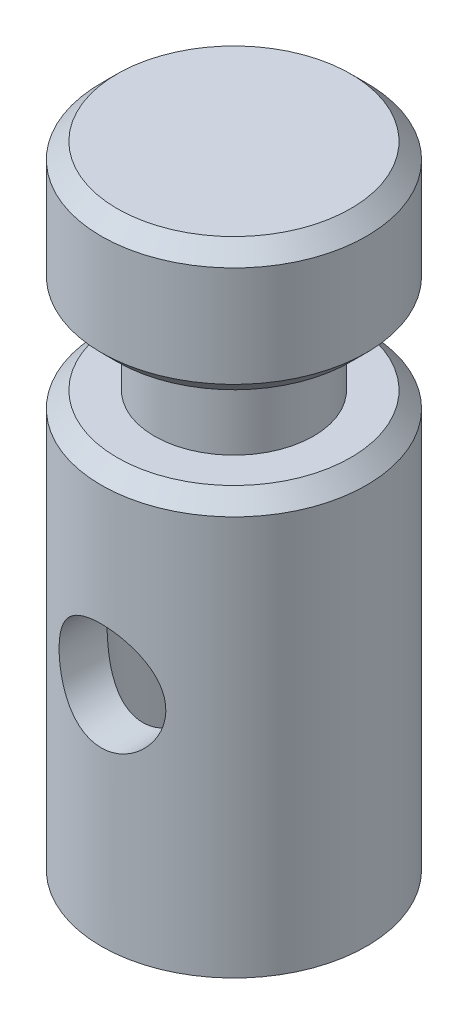
ISO-10303-21;
HEADER;
FILE_DESCRIPTION(('STEP AP214'),'2;1');
FILE_NAME('part.step','',(''),(''),'','','');
FILE_SCHEMA(('AUTOMOTIVE_DESIGN { 1 0 10303 214 1 1 1 1 }'));
ENDSEC;
DATA;
#1=APPLICATION_CONTEXT('core data for automotive mechanical design processes');
#2=APPLICATION_PROTOCOL_DEFINITION('international standard','automotive_design',2000,#1);
#3=PRODUCT_CONTEXT('',#1,'mechanical');
#4=PRODUCT('Part','Part','',(#3));
#5=PRODUCT_RELATED_PRODUCT_CATEGORY('part','',(#4));
#6=PRODUCT_DEFINITION_FORMATION('','',#4);
#7=PRODUCT_DEFINITION_CONTEXT('part definition',#1,'design');
#8=PRODUCT_DEFINITION('design','',#6,#7);
#9=PRODUCT_DEFINITION_SHAPE('','',#8);
#10=(LENGTH_UNIT() NAMED_UNIT(*) SI_UNIT(.MILLI.,.METRE.));
#11=(NAMED_UNIT(*) PLANE_ANGLE_UNIT() SI_UNIT($,.RADIAN.));
#12=(NAMED_UNIT(*) SI_UNIT($,.STERADIAN.) SOLID_ANGLE_UNIT());
#13=UNCERTAINTY_MEASURE_WITH_UNIT(LENGTH_MEASURE(1.E-05),#10,'distance_accuracy_value','');
#14=(GEOMETRIC_REPRESENTATION_CONTEXT(3) GLOBAL_UNCERTAINTY_ASSIGNED_CONTEXT((#13)) GLOBAL_UNIT_ASSIGNED_CONTEXT((#10,
#11,#12)) REPRESENTATION_CONTEXT('',''));
#15=CARTESIAN_POINT('',(0.,0.,0.));
#16=DIRECTION('',(0.,0.,1.));
#17=DIRECTION('',(1.,0.,0.));
#18=AXIS2_PLACEMENT_3D('',#15,#16,#17);
#19=CARTESIAN_POINT('',(0.,39.751,0.));
#20=DIRECTION('',(0.,-1.,0.));
#21=DIRECTION('',(0.,0.,-1.));
#22=AXIS2_PLACEMENT_3D('',#19,#20,#21);
#23=CYLINDRICAL_SURFACE('',#22,12.7);
#24=CARTESIAN_POINT('',(-3.77181718596579,18.1212140500163,12.1269697416814));
#25=CARTESIAN_POINT('',(-3.96276910871734,18.331479790591,12.0675770412481));
#26=CARTESIAN_POINT('',(-4.13655793992194,18.5579973712225,12.0085612167018));
#27=CARTESIAN_POINT('',(-4.4452734718245,19.0385215717042,11.8977595104715));
#28=CARTESIAN_POINT('',(-4.58010723982905,19.2925919705941,11.8459910674768));
#29=CARTESIAN_POINT('',(-4.74985289218351,19.6894762071165,11.7784794366222));
#30=CARTESIAN_POINT('',(-4.80107405321141,19.8246337792431,11.757640104756));
#31=CARTESIAN_POINT('',(-4.8921330150949,20.0992646778513,11.7200458273349));
#32=CARTESIAN_POINT('',(-4.93197525366238,20.2387362982957,11.7032892898901));
#33=CARTESIAN_POINT('',(-4.99984124108788,20.5208722846478,11.6744569897461));
#34=CARTESIAN_POINT('',(-5.02787488342697,20.6635338719696,11.6623773093704));
#35=CARTESIAN_POINT('',(-5.0718590222827,20.951044009711,11.6433167381532));
#36=CARTESIAN_POINT('',(-5.08781033583626,21.0958924115771,11.6363355025434));
#37=CARTESIAN_POINT('',(-5.10689601765167,21.3785084209263,11.6279711293696));
#38=CARTESIAN_POINT('',(-5.11069213689455,21.5162232139079,11.6262990001784));
#39=CARTESIAN_POINT('',(-5.10729533507349,21.7915399764374,11.627791651355));
#40=CARTESIAN_POINT('',(-5.1000986646958,21.9291418914686,11.6309580820117));
#41=CARTESIAN_POINT('',(-5.0747910311776,22.2031031491138,11.6420223819877));
#42=CARTESIAN_POINT('',(-5.05668322399909,22.339462839459,11.6499188831667));
#43=CARTESIAN_POINT('',(-5.00973971606266,22.6100337993392,11.6701825144876));
#44=CARTESIAN_POINT('',(-4.9808999308457,22.7442442305822,11.682551346693));
#45=CARTESIAN_POINT('',(-4.91366278991383,23.0060830442358,11.7109868554465));
#46=CARTESIAN_POINT('',(-4.87553399558724,23.1337918128931,11.7269488033761));
#47=CARTESIAN_POINT('',(-4.78970104597987,23.3854823524871,11.7622664153013));
#48=CARTESIAN_POINT('',(-4.74199353742511,23.5094628007049,11.7816232674691));
#49=CARTESIAN_POINT('',(-4.58504370313876,23.8746848864653,11.8439896308036));
#50=CARTESIAN_POINT('',(-4.46192538809221,24.1093951852117,11.8913165930695));
#51=CARTESIAN_POINT('',(-4.1732973008596,24.5701067354085,11.9957721911512));
#52=CARTESIAN_POINT('',(-4.00560939750171,24.7946332609024,12.0533299378264));
#53=CARTESIAN_POINT('',(-3.63603298053494,25.2134546357282,12.1699089386624));
#54=CARTESIAN_POINT('',(-3.43413138170208,25.4077378635874,12.2289307453612));
#55=CARTESIAN_POINT('',(-3.10351382465083,25.6774059104543,12.3155252184897));
#56=CARTESIAN_POINT('',(-2.98540041478488,25.7655363689735,12.3447584768584));
#57=CARTESIAN_POINT('',(-2.74167369461556,25.9314526613301,12.4011628470323));
#58=CARTESIAN_POINT('',(-2.61606331657462,26.0092425017324,12.4283347557637));
#59=CARTESIAN_POINT('',(-2.35809356693055,26.153852492098,12.4798519166861));
#60=CARTESIAN_POINT('',(-2.22573274060292,26.2206702643727,12.5041965558634));
#61=CARTESIAN_POINT('',(-1.95523790796833,26.3426717816537,12.5493358187933));
#62=CARTESIAN_POINT('',(-1.81710672636611,26.3978611408559,12.5701321547394));
#63=CARTESIAN_POINT('',(-1.5411826855351,26.4942713699108,12.6068795641394));
#64=CARTESIAN_POINT('',(-1.4035626196454,26.5359297001533,12.6229801641663));
#65=CARTESIAN_POINT('',(-1.12493089204489,26.607498805121,12.6508545383357));
#66=CARTESIAN_POINT('',(-0.983920775843403,26.6374148292376,12.6626302457671));
#67=CARTESIAN_POINT('',(-0.699590631932819,26.6851815603418,12.6815167976717));
#68=CARTESIAN_POINT('',(-0.556271086242462,26.7030347524979,12.6886286029867));
#69=CARTESIAN_POINT('',(-0.268476684467399,26.7264728543972,12.6979779271349));
#70=CARTESIAN_POINT('',(-0.124001891176247,26.732058426459,12.7002157091125));
#71=CARTESIAN_POINT('',(0.155071312499817,26.7309363742293,12.6997671620276));
#72=CARTESIAN_POINT('',(0.289674284989054,26.7250376544113,12.6974048422712));
#73=CARTESIAN_POINT('',(0.557892789727701,26.702585597814,12.6884500784288));
#74=CARTESIAN_POINT('',(0.691507979745318,26.6860287286535,12.6818562319094));
#75=CARTESIAN_POINT('',(0.956693780455195,26.6424357852721,12.6646115883794));
#76=CARTESIAN_POINT('',(1.08826518236065,26.615403877013,12.6539624042205));
#77=CARTESIAN_POINT('',(1.34856438649542,26.5511165522338,12.6288748902392));
#78=CARTESIAN_POINT('',(1.47729108969142,26.513857256533,12.6144351227644));
#79=CARTESIAN_POINT('',(1.73051948112091,26.4296266562699,12.5821906761607));
#80=CARTESIAN_POINT('',(1.85503592066784,26.3826945170368,12.5643995907601));
#81=CARTESIAN_POINT('',(2.09964751407949,26.2794301733359,12.525847099022));
#82=CARTESIAN_POINT('',(2.21974108009293,26.2230946323539,12.5050846387559));
#83=CARTESIAN_POINT('',(2.5723126524262,26.0406237670823,12.4390594715543));
#84=CARTESIAN_POINT('',(2.79726327878376,25.9009632665654,12.3900347774171));
#85=CARTESIAN_POINT('',(3.23547030307071,25.5796514559119,12.2831558437914));
#86=CARTESIAN_POINT('',(3.44708702303494,25.3959028937258,12.2249392560892));
#87=CARTESIAN_POINT('',(3.83774029087882,24.9963156024814,12.1079868117843));
#88=CARTESIAN_POINT('',(4.01676234308697,24.7804626729559,12.0492507362691));
#89=CARTESIAN_POINT('',(4.26166097168353,24.430608789737,11.9639569342589));
#90=CARTESIAN_POINT('',(4.34095614966722,24.3062861209076,11.9353392656973));
#91=CARTESIAN_POINT('',(4.48878352876408,24.0509081649402,11.8805314347358));
#92=CARTESIAN_POINT('',(4.55731992723245,23.9198555299991,11.8543403272966));
#93=CARTESIAN_POINT('',(4.68308105853712,23.6518240242448,11.8052241163442));
#94=CARTESIAN_POINT('',(4.74030429308252,23.5148443713943,11.7822994455429));
#95=CARTESIAN_POINT('',(4.84287647557451,23.2359734916343,11.7405117461151));
#96=CARTESIAN_POINT('',(4.88823120997823,23.094084696513,11.7216467390099));
#97=CARTESIAN_POINT('',(4.96519560631351,22.8116400684367,11.6892477811511));
#98=CARTESIAN_POINT('',(4.99724534063512,22.6712235791153,11.6755448340819));
#99=CARTESIAN_POINT('',(5.04955146250478,22.3878832336622,11.6530186450872));
#100=CARTESIAN_POINT('',(5.06981310232975,22.244960523483,11.6441932300274));
#101=CARTESIAN_POINT('',(5.09832667895424,21.9577268927683,11.631737114166));
#102=CARTESIAN_POINT('',(5.10658123331378,21.8134162817042,11.6281052811598));
#103=CARTESIAN_POINT('',(5.11098899520402,21.5245780920415,11.6261687051452));
#104=CARTESIAN_POINT('',(5.10714279310263,21.3800505243716,11.6278637022532));
#105=CARTESIAN_POINT('',(5.08807620022158,21.1018716129782,11.6362182911536));
#106=CARTESIAN_POINT('',(5.07365402327184,20.9681541842316,11.6425294031014));
#107=CARTESIAN_POINT('',(5.0344981628639,20.7024761033003,11.659514700073));
#108=CARTESIAN_POINT('',(5.00976107346097,20.5705160462587,11.6701903262199));
#109=CARTESIAN_POINT('',(4.95021697949083,20.3093155516272,11.6955717453469));
#110=CARTESIAN_POINT('',(4.91541248814528,20.1800744439074,11.7102765324408));
#111=CARTESIAN_POINT('',(4.83604815123563,19.9250763869468,11.7432736336639));
#112=CARTESIAN_POINT('',(4.7914845587238,19.7993207968991,11.7615673254495));
#113=CARTESIAN_POINT('',(4.64212621763297,19.4245711495633,11.8216905466086));
#114=CARTESIAN_POINT('',(4.52256913755063,19.1820480215133,11.8683549981249));
#115=CARTESIAN_POINT('',(4.24800846130576,18.7198836085234,11.9693665481484));
#116=CARTESIAN_POINT('',(4.09299185232765,18.5002507669594,12.0237164642383));
#117=CARTESIAN_POINT('',(3.73836820108481,18.0729009077759,12.1388573527753));
#118=CARTESIAN_POINT('',(3.53631640989572,17.8672559526222,12.1998277876548));
#119=CARTESIAN_POINT('',(3.09973919809829,17.492188338058,12.317977291408));
#120=CARTESIAN_POINT('',(2.8652075954145,17.3227725900228,12.3751556354391));
#121=CARTESIAN_POINT('',(2.4913759923478,17.0984261947742,12.4539052394785));
#122=CARTESIAN_POINT('',(2.36185206054746,17.0281238507163,12.479175927667));
#123=CARTESIAN_POINT('',(2.09673024245632,16.8988120043533,12.526444318242));
#124=CARTESIAN_POINT('',(1.96113487139429,16.8397978781028,12.5484433599542));
#125=CARTESIAN_POINT('',(1.68484569662164,16.7336534615323,12.5885179863698));
#126=CARTESIAN_POINT('',(1.54415296090299,16.686520698128,12.6065943874548));
#127=CARTESIAN_POINT('',(1.25871856456134,16.6046332999579,12.6382845231959));
#128=CARTESIAN_POINT('',(1.11397720480493,16.5698777480225,12.6518985885117));
#129=CARTESIAN_POINT('',(0.830871507068253,16.5149450297961,12.6735362217369));
#130=CARTESIAN_POINT('',(0.69268121373776,16.4939862380752,12.6818583868194));
#131=CARTESIAN_POINT('',(0.414849489263431,16.4635207753416,12.6939839783611));
#132=CARTESIAN_POINT('',(0.275208136977741,16.4540134852434,12.6977876490969));
#133=CARTESIAN_POINT('',(-0.0043821036097783,16.4465591745105,12.7007684764357));
#134=CARTESIAN_POINT('',(-0.144330865867718,16.4486080719213,12.6999472666703));
#135=CARTESIAN_POINT('',(-0.423477571598754,16.4642332492299,12.6937053571333));
#136=CARTESIAN_POINT('',(-0.562675532861454,16.4778092547841,12.6882847668263));
#137=CARTESIAN_POINT('',(-0.832455684723967,16.5153900475756,12.6733724036667));
#138=CARTESIAN_POINT('',(-0.963125848817985,16.5388512637075,12.6640931198247));
#139=CARTESIAN_POINT('',(-1.22196462758602,16.5958380659261,12.6417437486468));
#140=CARTESIAN_POINT('',(-1.35013239268249,16.6293670088885,12.6286723969735));
#141=CARTESIAN_POINT('',(-1.60313615901242,16.7061923192327,12.599054509338));
#142=CARTESIAN_POINT('',(-1.72797121591983,16.7494914228284,12.5825069999391));
#143=CARTESIAN_POINT('',(-1.97353516609666,16.8454781644152,12.5463379899786));
#144=CARTESIAN_POINT('',(-2.09426259561154,16.8981691083149,12.5267154072923));
#145=CARTESIAN_POINT('',(-2.4564448236815,17.0732191426911,12.4626245470742));
#146=CARTESIAN_POINT('',(-2.69023535909803,17.2102272965992,12.4138660241384));
#147=CARTESIAN_POINT('',(-3.13186395625568,17.5182636421715,12.3098707348858));
#148=CARTESIAN_POINT('',(-3.33975153668651,17.6892252492559,12.2546467333887));
#149=CARTESIAN_POINT('',(-3.57392302312484,17.9147027296095,12.1868341057623));
#150=CARTESIAN_POINT('',(-3.61446618691323,17.9550740381826,12.1748661843813));
#151=CARTESIAN_POINT('',(-3.69417752797367,18.0371483455142,12.1509169900603));
#152=CARTESIAN_POINT('',(-3.73334569074235,18.0788513583104,12.1389357169808));
#153=CARTESIAN_POINT('',(-3.77181718596579,18.1212140500163,12.1269697416814));
#154=B_SPLINE_CURVE_WITH_KNOTS('',3,(#24,#25,#26,#27,#28,#29,#30,#31,#32,#33,#34,#35,#36,#37,
#38,#39,#40,#41,#42,#43,#44,#45,#46,#47,#48,#49,#50,#51,#52,#53,#54,#55,#56,#57,#58,#59,#60,#61,
#62,#63,#64,#65,#66,#67,#68,#69,#70,#71,#72,#73,#74,#75,#76,#77,#78,#79,#80,#81,#82,#83,#84,#85,
#86,#87,#88,#89,#90,#91,#92,#93,#94,#95,#96,#97,#98,#99,#100,#101,#102,#103,#104,#105,#106,#107,
#108,#109,#110,#111,#112,#113,#114,#115,#116,#117,#118,#119,#120,#121,#122,#123,#124,#125,#126,
#127,#128,#129,#130,#131,#132,#133,#134,#135,#136,#137,#138,#139,#140,#141,#142,#143,#144,#145,
#146,#147,#148,#149,#150,#151,#152,#153),.UNSPECIFIED.,.T.,.F.,(4,2,2,2,2,2,2,2,2,2,2,2,2,2,2,2,
2,2,2,2,2,2,2,2,2,2,2,2,2,2,2,2,2,2,2,2,2,2,2,2,2,2,2,2,2,2,2,2,2,2,2,2,2,2,2,2,2,2,2,2,2,2,2,2,
4),(0.,0.870325793777426,1.74271104222307,2.18033144273261,2.61778094011256,3.05486320094055,
3.49191590254705,3.90473019814493,4.31768532386917,4.73052106281165,5.1435140829283,
5.54574804016576,5.94812305598112,6.75229376142162,7.60701139169735,8.46205665447079,
8.9123165615474,9.36240149971053,9.81258384462424,10.2625483410035,10.6960376493083,
11.1293329451327,11.5625389467986,11.9957215594571,12.3994930173615,12.8033983643286,
13.2071432412369,13.6110414680266,14.0133353546335,14.4157722877418,15.2200730893395,
16.0752476990156,16.9308017023825,17.3809684519407,17.8309591377548,18.2810093794961,
18.7308397898428,19.1643030509437,19.597573030926,20.0307485433342,20.4639029224392,
20.8673485735435,21.2709275464851,21.6744058569775,22.0780393529701,22.8973928962485,
23.7170476068233,24.5971273153919,25.4773747655746,25.9254619578619,26.373365207142,
26.8211751490423,27.2689519006618,27.6884690032347,28.1079634250599,28.5273096795175,
28.9466459538778,29.3454360055552,29.7443591734711,30.1433942020661,30.5425699685533,
31.364830520097,32.1854942188302,32.3608387823871,32.5361851949064),.UNSPECIFIED.);
#155=CARTESIAN_POINT('',(-3.77181718596579,18.1212140500163,12.1269697416814));
#156=VERTEX_POINT('',#155);
#157=EDGE_CURVE('E79',#156,#156,#154,.T.);
#158=ORIENTED_EDGE('',*,*,#157,.T.);
#159=EDGE_LOOP('',(#158));
#160=FACE_BOUND('',#159,.T.);
#161=CARTESIAN_POINT('',(0.,38.227,0.));
#162=DIRECTION('',(0.,1.,0.));
#163=DIRECTION('',(0.,0.,1.));
#164=AXIS2_PLACEMENT_3D('',#161,#162,#163);
#165=CIRCLE('',#164,12.7);
#166=CARTESIAN_POINT('',(0.,38.227,12.7));
#167=VERTEX_POINT('',#166);
#168=EDGE_CURVE('E10',#167,#167,#165,.F.);
#169=ORIENTED_EDGE('',*,*,#168,.T.);
#170=EDGE_LOOP('',(#169));
#171=FACE_BOUND('',#170,.T.);
#172=CARTESIAN_POINT('',(0.,0.,0.));
#173=DIRECTION('',(0.,1.,0.));
#174=DIRECTION('',(0.,0.,1.));
#175=AXIS2_PLACEMENT_3D('',#172,#173,#174);
#176=CIRCLE('',#175,12.7);
#177=CARTESIAN_POINT('',(0.,0.,12.7));
#178=VERTEX_POINT('',#177);
#179=EDGE_CURVE('E59',#178,#178,#176,.T.);
#180=ORIENTED_EDGE('',*,*,#179,.T.);
#181=EDGE_LOOP('',(#180));
#182=FACE_BOUND('',#181,.T.);
#183=ADVANCED_FACE('F32',(#160,#171,#182),#23,.T.);
#184=CARTESIAN_POINT('',(0.,39.751,0.));
#185=DIRECTION('',(0.,1.,0.));
#186=DIRECTION('',(0.,0.,1.));
#187=AXIS2_PLACEMENT_3D('',#184,#185,#186);
#188=PLANE('',#187);
#189=CARTESIAN_POINT('',(0.,39.751,0.));
#190=DIRECTION('',(0.,1.,0.));
#191=DIRECTION('',(0.,0.,1.));
#192=AXIS2_PLACEMENT_3D('',#189,#190,#191);
#193=CIRCLE('',#192,11.176);
#194=CARTESIAN_POINT('',(0.,39.751,11.176));
#195=VERTEX_POINT('',#194);
#196=EDGE_CURVE('E39',#195,#195,#193,.T.);
#197=ORIENTED_EDGE('',*,*,#196,.T.);
#198=EDGE_LOOP('',(#197));
#199=FACE_BOUND('',#198,.T.);
#200=CARTESIAN_POINT('',(0.,39.751,0.));
#201=DIRECTION('',(0.,1.,0.));
#202=DIRECTION('',(0.,0.,1.));
#203=AXIS2_PLACEMENT_3D('',#200,#201,#202);
#204=CIRCLE('',#203,7.62);
#205=CARTESIAN_POINT('',(0.,39.751,7.62));
#206=VERTEX_POINT('',#205);
#207=EDGE_CURVE('E62',#206,#206,#204,.T.);
#208=ORIENTED_EDGE('',*,*,#207,.F.);
#209=EDGE_LOOP('',(#208));
#210=FACE_BOUND('',#209,.T.);
#211=ADVANCED_FACE('F136',(#199,#210),#188,.T.);
#212=CARTESIAN_POINT('',(0.,0.,0.));
#213=DIRECTION('',(0.,1.,0.));
#214=DIRECTION('',(0.,0.,1.));
#215=AXIS2_PLACEMENT_3D('',#212,#213,#214);
#216=PLANE('',#215);
#217=CARTESIAN_POINT('',(0.,0.,0.));
#218=DIRECTION('',(0.,-1.,0.));
#219=DIRECTION('',(0.,0.,-1.));
#220=AXIS2_PLACEMENT_3D('',#217,#218,#219);
#221=CIRCLE('',#220,8.73125);
#222=CARTESIAN_POINT('',(0.,0.,-8.73125));
#223=VERTEX_POINT('',#222);
#224=EDGE_CURVE('E64',#223,#223,#221,.T.);
#225=ORIENTED_EDGE('',*,*,#224,.F.);
#226=EDGE_LOOP('',(#225));
#227=FACE_BOUND('',#226,.T.);
#228=ORIENTED_EDGE('',*,*,#179,.F.);
#229=EDGE_LOOP('',(#228));
#230=FACE_BOUND('',#229,.T.);
#231=ADVANCED_FACE('F134',(#227,#230),#216,.F.);
#232=CARTESIAN_POINT('',(0.,30.226,0.));
#233=DIRECTION('',(0.,-1.,0.));
#234=DIRECTION('',(0.,0.,-1.));
#235=AXIS2_PLACEMENT_3D('',#232,#233,#234);
#236=CYLINDRICAL_SURFACE('',#235,8.73125);
#237=CARTESIAN_POINT('',(-3.69084189503472,18.2196104406997,7.91280055765585));
#238=CARTESIAN_POINT('',(-3.50648849955159,18.0139084103919,7.99878755988671));
#239=CARTESIAN_POINT('',(-3.30503243725836,17.8233905857175,8.08489015797121));
#240=CARTESIAN_POINT('',(-2.87086337394761,17.4768765186165,8.24903824232721));
#241=CARTESIAN_POINT('',(-2.6381227217793,17.3209111423364,8.32707649168016));
#242=CARTESIAN_POINT('',(-2.26855366299631,17.1166024492784,8.43237993338454));
#243=CARTESIAN_POINT('',(-2.14150968371236,17.0532831463631,8.46561034990679));
#244=CARTESIAN_POINT('',(-1.88147445578869,16.9374371474363,8.52716767197852));
#245=CARTESIAN_POINT('',(-1.74848602357497,16.8849054050143,8.5554968693323));
#246=CARTESIAN_POINT('',(-1.47757817049173,16.7913373987516,8.60642074242971));
#247=CARTESIAN_POINT('',(-1.3396626955414,16.7502921585598,8.62901989472345));
#248=CARTESIAN_POINT('',(-1.05992658005821,16.6802477929551,8.66782599006351));
#249=CARTESIAN_POINT('',(-0.918106455247376,16.6512470847744,8.68403377298329));
#250=CARTESIAN_POINT('',(-0.646101178764852,16.6080238613529,8.70827380449505));
#251=CARTESIAN_POINT('',(-0.516160881424349,16.5926188567338,8.71695860337945));
#252=CARTESIAN_POINT('',(-0.255213161869679,16.5721750838703,8.72849605782839));
#253=CARTESIAN_POINT('',(-0.124205826797048,16.5671354774723,8.73134918494587));
#254=CARTESIAN_POINT('',(0.137759355439296,16.5674956030767,8.73114555527385));
#255=CARTESIAN_POINT('',(0.268717207135284,16.5728930208454,8.72809010861064));
#256=CARTESIAN_POINT('',(0.529520974739891,16.5940425547433,8.71615599303986));
#257=CARTESIAN_POINT('',(0.659366921342994,16.6097943840963,8.70727748540807));
#258=CARTESIAN_POINT('',(0.907450302062027,16.6499013489774,8.68479198356668));
#259=CARTESIAN_POINT('',(1.02584011317536,16.6735399402522,8.67158000298558));
#260=CARTESIAN_POINT('',(1.26003418685346,16.7292398493109,8.64066089620956));
#261=CARTESIAN_POINT('',(1.37583762641907,16.7613038078063,8.62295236074546));
#262=CARTESIAN_POINT('',(1.71825328915825,16.8696371961618,8.56363379263807));
#263=CARTESIAN_POINT('',(1.94006990028098,16.9580809305973,8.51581184176755));
#264=CARTESIAN_POINT('',(2.37866974916417,17.1702747479436,8.40422291185368));
#265=CARTESIAN_POINT('',(2.5943850386283,17.2957991045103,8.33968202889504));
#266=CARTESIAN_POINT('',(3.00278915980663,17.575903274784,8.20149529643184));
#267=CARTESIAN_POINT('',(3.19546563379104,17.7304985684215,8.12784460324486));
#268=CARTESIAN_POINT('',(3.57848029724296,18.087205013728,7.96728433909696));
#269=CARTESIAN_POINT('',(3.76533720983835,18.2928691296735,7.87988706286317));
#270=CARTESIAN_POINT('',(4.01872559782915,18.6230334218994,7.75200589503277));
#271=CARTESIAN_POINT('',(4.09876239277966,18.7368059887505,7.70988003081896));
#272=CARTESIAN_POINT('',(4.24947764209788,18.9712279121019,7.62784452552918));
#273=CARTESIAN_POINT('',(4.32015456434516,19.0918783898373,7.58793524790618));
#274=CARTESIAN_POINT('',(4.45524789838693,19.3463610395616,7.50945646171371));
#275=CARTESIAN_POINT('',(4.5191018058421,19.4805531973435,7.47108315463656));
#276=CARTESIAN_POINT('',(4.63510786953948,19.7552052374148,7.39967175124223));
#277=CARTESIAN_POINT('',(4.68726611247326,19.8956618137127,7.36663088232321));
#278=CARTESIAN_POINT('',(4.77915597896398,20.1817536384047,7.30735150230445));
#279=CARTESIAN_POINT('',(4.81890624054274,20.3273807500584,7.28110279894012));
#280=CARTESIAN_POINT('',(4.88541097310221,20.6227696617718,7.23664956422182));
#281=CARTESIAN_POINT('',(4.91216858055521,20.7725304547113,7.21844309154106));
#282=CARTESIAN_POINT('',(4.94948660829477,21.0544242095946,7.1928953463128));
#283=CARTESIAN_POINT('',(4.96173564665625,21.1862335462607,7.1844259446132));
#284=CARTESIAN_POINT('',(4.97589187057092,21.450665909864,7.17462923355758));
#285=CARTESIAN_POINT('',(4.97780027115218,21.5832888393705,7.17330108510228));
#286=CARTESIAN_POINT('',(4.97124353466982,21.8481339910082,7.17784638122239));
#287=CARTESIAN_POINT('',(4.96277963266452,21.9803562589681,7.18371896838666));
#288=CARTESIAN_POINT('',(4.93562585482908,22.2432427856028,7.20240194957057));
#289=CARTESIAN_POINT('',(4.91693620894537,22.3739070792443,7.21521218758309));
#290=CARTESIAN_POINT('',(4.87215284927863,22.618807614694,7.24551574371174));
#291=CARTESIAN_POINT('',(4.84706165640657,22.7333094051696,7.26236371156251));
#292=CARTESIAN_POINT('',(4.78923690582713,22.9596026052986,7.30062555127666));
#293=CARTESIAN_POINT('',(4.75650087738382,23.0713931257751,7.32204089907798));
#294=CARTESIAN_POINT('',(4.64729428529532,23.4018164096695,7.39221905166241));
#295=CARTESIAN_POINT('',(4.55979923493148,23.6156405096363,7.44693247340235));
#296=CARTESIAN_POINT('',(4.34681813850397,24.0497519170207,7.57342790804595));
#297=CARTESIAN_POINT('',(4.21819478008542,24.2681257802594,7.64642996973659));
#298=CARTESIAN_POINT('',(3.93078259830131,24.6819293005112,7.79808601666348));
#299=CARTESIAN_POINT('',(3.77197069807842,24.8773412187226,7.87674429686506));
#300=CARTESIAN_POINT('',(3.40085414449287,25.2694816810585,8.04463206501982));
#301=CARTESIAN_POINT('',(3.18411375260823,25.4621469688794,8.13370814460435));
#302=CARTESIAN_POINT('',(2.83461304876611,25.7217966290227,8.25924540547169));
#303=CARTESIAN_POINT('',(2.71396353280385,25.8034976180077,8.2997681457292));
#304=CARTESIAN_POINT('',(2.46508590788988,25.9564209828044,8.37705268990399));
#305=CARTESIAN_POINT('',(2.33686186494118,26.0276489101755,8.41381648319211));
#306=CARTESIAN_POINT('',(2.07591493808545,26.1577046645907,8.48193188033684));
#307=CARTESIAN_POINT('',(1.94331338171969,26.2167313211651,8.51336845392877));
#308=CARTESIAN_POINT('',(1.67244673899312,26.3232037086864,8.57069385615593));
#309=CARTESIAN_POINT('',(1.53418466848896,26.370655515171,8.59658559435191));
#310=CARTESIAN_POINT('',(1.25314168575978,26.4532960282552,8.64202566235404));
#311=CARTESIAN_POINT('',(1.11036449770687,26.4884945679508,8.66157907771489));
#312=CARTESIAN_POINT('',(0.821489380135568,26.546103142669,8.69373269848013));
#313=CARTESIAN_POINT('',(0.675391989765647,26.5685152387954,8.70633402451207));
#314=CARTESIAN_POINT('',(0.400581294489291,26.598092025686,8.72299628666436));
#315=CARTESIAN_POINT('',(0.272093193141292,26.6068674177637,8.72795859195868));
#316=CARTESIAN_POINT('',(0.0147338302035365,26.6143444988242,8.73218563738757));
#317=CARTESIAN_POINT('',(-0.114137401121557,26.6130469634182,8.73145081619844));
#318=CARTESIAN_POINT('',(-0.371199804522616,26.6003977850215,8.72430336539021));
#319=CARTESIAN_POINT('',(-0.499391098146795,26.5890480044363,8.7178917875186));
#320=CARTESIAN_POINT('',(-0.754106885101389,26.5564560024264,8.69956063974566));
#321=CARTESIAN_POINT('',(-0.880631383756393,26.5352138126109,8.68764108744399));
#322=CARTESIAN_POINT('',(-1.1239932214643,26.4845892851536,8.6594173784368));
#323=CARTESIAN_POINT('',(-1.24097396935932,26.45573471704,8.64339902425399));
#324=CARTESIAN_POINT('',(-1.47192170155289,26.3897876350526,8.60708222540597));
#325=CARTESIAN_POINT('',(-1.58588771907838,26.3526925135686,8.58678242603918));
#326=CARTESIAN_POINT('',(-1.92223525921951,26.2295958481301,8.52008406025599));
#327=CARTESIAN_POINT('',(-2.1392519916106,26.1317437449521,8.46786400832588));
#328=CARTESIAN_POINT('',(-2.57040870064609,25.89925514549,8.34755409352758));
#329=CARTESIAN_POINT('',(-2.78307984238899,25.7623902393368,8.27856047596064));
#330=CARTESIAN_POINT('',(-3.18377259530261,25.4596885337023,8.13288608789267));
#331=CARTESIAN_POINT('',(-3.37177755949958,25.2938323425579,8.05620018690808));
#332=CARTESIAN_POINT('',(-3.74313590651636,24.9132056336219,7.89113494503034));
#333=CARTESIAN_POINT('',(-3.92279138076865,24.6948887841713,7.8025186179727));
#334=CARTESIAN_POINT('',(-4.16363664790113,24.3458873308434,7.67510081640244));
#335=CARTESIAN_POINT('',(-4.23919121787868,24.2258678966072,7.63351693743551));
#336=CARTESIAN_POINT('',(-4.3803085703467,23.9790339919286,7.55342250566816));
#337=CARTESIAN_POINT('',(-4.44586994339292,23.8522185663797,7.51491238675619));
#338=CARTESIAN_POINT('',(-4.56811942474984,23.5887199595441,7.44125378231122));
#339=CARTESIAN_POINT('',(-4.62450076849613,23.4518584227302,7.4062326582923));
#340=CARTESIAN_POINT('',(-4.72536542402409,23.1725067651904,7.3422895875576));
#341=CARTESIAN_POINT('',(-4.76985541603441,23.0300198564976,7.31336421835764));
#342=CARTESIAN_POINT('',(-4.84624025572317,22.7406636581501,7.26297312218422));
#343=CARTESIAN_POINT('',(-4.87815595368951,22.5938020612225,7.2414950534916));
#344=CARTESIAN_POINT('',(-4.92890153081517,22.2968601698569,7.2070526163259));
#345=CARTESIAN_POINT('',(-4.94773460516612,22.1467806705698,7.19408616908751));
#346=CARTESIAN_POINT('',(-4.97010132542821,21.8678451255251,7.17864651912584));
#347=CARTESIAN_POINT('',(-4.97551624447855,21.7392074858441,7.1748841611998));
#348=CARTESIAN_POINT('',(-4.9765562234249,21.4818789044849,7.17416318938684));
#349=CARTESIAN_POINT('',(-4.97218210670089,21.3531879681999,7.17720400326833));
#350=CARTESIAN_POINT('',(-4.95370926928407,21.0968011711077,7.1899664433565));
#351=CARTESIAN_POINT('',(-4.93960760803878,20.9691056230052,7.19969008972232));
#352=CARTESIAN_POINT('',(-4.90190921312663,20.715799183339,7.22540793126697));
#353=CARTESIAN_POINT('',(-4.8783124664813,20.590188294625,7.24140213501679));
#354=CARTESIAN_POINT('',(-4.79803607546927,20.2367384174373,7.29503747047915));
#355=CARTESIAN_POINT('',(-4.73025954031836,20.0123592061637,7.33954248189604));
#356=CARTESIAN_POINT('',(-4.56596752325705,19.5782089250249,7.44284801172158));
#357=CARTESIAN_POINT('',(-4.46945923339755,19.3684342155973,7.50164495194017));
#358=CARTESIAN_POINT('',(-4.26652929176395,18.9960449445704,7.61859868423536));
#359=CARTESIAN_POINT('',(-4.16372218167359,18.831058695816,7.6755477464589));
#360=CARTESIAN_POINT('',(-3.94034912937425,18.5147735147448,7.79257865756304));
#361=CARTESIAN_POINT('',(-3.81977847343709,18.3634782327129,7.8526613352365));
#362=CARTESIAN_POINT('',(-3.69084189503472,18.2196104406997,7.91280055765585));
#363=B_SPLINE_CURVE_WITH_KNOTS('',3,(#237,#238,#239,#240,#241,#242,#243,#244,#245,#246,#247,
#248,#249,#250,#251,#252,#253,#254,#255,#256,#257,#258,#259,#260,#261,#262,#263,#264,#265,#266,
#267,#268,#269,#270,#271,#272,#273,#274,#275,#276,#277,#278,#279,#280,#281,#282,#283,#284,#285,
#286,#287,#288,#289,#290,#291,#292,#293,#294,#295,#296,#297,#298,#299,#300,#301,#302,#303,#304,
#305,#306,#307,#308,#309,#310,#311,#312,#313,#314,#315,#316,#317,#318,#319,#320,#321,#322,#323,
#324,#325,#326,#327,#328,#329,#330,#331,#332,#333,#334,#335,#336,#337,#338,#339,#340,#341,#342,
#343,#344,#345,#346,#347,#348,#349,#350,#351,#352,#353,#354,#355,#356,#357,#358,#359,#360,#361,
#362),.UNSPECIFIED.,.T.,.F.,(4,2,2,2,2,2,2,2,2,2,2,2,2,2,2,2,2,2,2,2,2,2,2,2,2,2,2,2,2,2,2,2,2,
2,2,2,2,2,2,2,2,2,2,2,2,2,2,2,2,2,2,2,2,2,2,2,2,2,2,2,2,2,4),(0.,0.867272486484077,
1.73531662229905,2.17217509489025,2.60882873760752,3.04514018983569,3.4813942883735,
3.87428112640233,4.26713619407663,4.65990416277227,5.05266125380595,5.41658286273961,
5.78061866974529,6.50808949672295,7.2784539534751,8.0492297877899,8.91903969173464,
9.35468939905939,9.79041033010563,10.2502316339492,10.7098130779809,11.1687008255082,
11.6274777407813,12.024846902892,12.422169372993,12.819444537422,13.2167107686862,
13.5715982026569,13.9266004918889,14.6361800170426,15.4244593928044,16.2133437895421,
17.118673025063,17.571912845391,18.0249115394983,18.4698158161126,18.9144860614086,
19.3587986372115,19.8030395720336,20.1891841507259,20.5752989967462,20.9613423212294,
21.3473844121948,21.7116136309079,22.0759582695573,22.8040805335954,23.5874733139397,
24.3713921085408,25.2559822240966,25.6989409231872,26.1419620396448,26.5976311848517,
27.0530438072813,27.5076980685821,27.9622412498152,28.348126070045,28.7339784337692,
29.1199474884653,29.5059170707294,30.2185674075579,30.9310395055612,31.5374477986225,
32.1440172987758),.UNSPECIFIED.);
#364=CARTESIAN_POINT('',(-3.69084189503472,18.2196104406997,7.91280055765585));
#365=VERTEX_POINT('',#364);
#366=EDGE_CURVE('E87',#365,#365,#363,.T.);
#367=ORIENTED_EDGE('',*,*,#366,.T.);
#368=EDGE_LOOP('',(#367));
#369=FACE_BOUND('',#368,.T.);
#370=CARTESIAN_POINT('',(0.,30.226,0.));
#371=DIRECTION('',(0.,-1.,0.));
#372=DIRECTION('',(0.,0.,-1.));
#373=AXIS2_PLACEMENT_3D('',#370,#371,#372);
#374=CIRCLE('',#373,8.73125);
#375=CARTESIAN_POINT('',(0.,30.226,-8.73125));
#376=VERTEX_POINT('',#375);
#377=EDGE_CURVE('E63',#376,#376,#374,.T.);
#378=ORIENTED_EDGE('',*,*,#377,.F.);
#379=EDGE_LOOP('',(#378));
#380=FACE_BOUND('',#379,.T.);
#381=ORIENTED_EDGE('',*,*,#224,.T.);
#382=EDGE_LOOP('',(#381));
#383=FACE_BOUND('',#382,.T.);
#384=ADVANCED_FACE('F130',(#369,#380,#383),#236,.F.);
#385=CARTESIAN_POINT('',(0.,30.226,0.));
#386=DIRECTION('',(0.,-1.,0.));
#387=DIRECTION('',(0.,0.,-1.));
#388=AXIS2_PLACEMENT_3D('',#385,#386,#387);
#389=PLANE('',#388);
#390=ORIENTED_EDGE('',*,*,#377,.T.);
#391=EDGE_LOOP('',(#390));
#392=FACE_BOUND('',#391,.T.);
#393=ADVANCED_FACE('F126',(#392),#389,.T.);
#394=CARTESIAN_POINT('',(0.,46.101,0.));
#395=DIRECTION('',(0.,-1.,0.));
#396=DIRECTION('',(0.,0.,-1.));
#397=AXIS2_PLACEMENT_3D('',#394,#395,#396);
#398=CYLINDRICAL_SURFACE('',#397,7.62);
#399=CARTESIAN_POINT('',(0.,46.101,0.));
#400=DIRECTION('',(0.,1.,0.));
#401=DIRECTION('',(0.,0.,1.));
#402=AXIS2_PLACEMENT_3D('',#399,#400,#401);
#403=CIRCLE('',#402,7.62);
#404=CARTESIAN_POINT('',(0.,46.101,7.62));
#405=VERTEX_POINT('',#404);
#406=EDGE_CURVE('E67',#405,#405,#403,.T.);
#407=ORIENTED_EDGE('',*,*,#406,.F.);
#408=EDGE_LOOP('',(#407));
#409=FACE_BOUND('',#408,.T.);
#410=ORIENTED_EDGE('',*,*,#207,.T.);
#411=EDGE_LOOP('',(#410));
#412=FACE_BOUND('',#411,.T.);
#413=ADVANCED_FACE('F122',(#409,#412),#398,.T.);
#414=CARTESIAN_POINT('',(0.,46.101,0.));
#415=DIRECTION('',(0.,1.,0.));
#416=DIRECTION('',(0.,0.,1.));
#417=AXIS2_PLACEMENT_3D('',#414,#415,#416);
#418=PLANE('',#417);
#419=CARTESIAN_POINT('',(0.,46.101,0.));
#420=DIRECTION('',(0.,1.,0.));
#421=DIRECTION('',(0.,0.,1.));
#422=AXIS2_PLACEMENT_3D('',#419,#420,#421);
#423=CIRCLE('',#422,3.175);
#424=CARTESIAN_POINT('',(0.,46.101,3.175));
#425=VERTEX_POINT('',#424);
#426=EDGE_CURVE('E58',#425,#425,#423,.T.);
#427=ORIENTED_EDGE('',*,*,#426,.F.);
#428=EDGE_LOOP('',(#427));
#429=FACE_BOUND('',#428,.T.);
#430=ORIENTED_EDGE('',*,*,#406,.T.);
#431=EDGE_LOOP('',(#430));
#432=FACE_BOUND('',#431,.T.);
#433=ADVANCED_FACE('F118',(#429,#432),#418,.T.);
#434=CARTESIAN_POINT('',(0.,47.6885,0.));
#435=DIRECTION('',(0.,-1.,0.));
#436=DIRECTION('',(0.,0.,-1.));
#437=AXIS2_PLACEMENT_3D('',#434,#435,#436);
#438=CYLINDRICAL_SURFACE('',#437,3.175);
#439=CARTESIAN_POINT('',(0.,47.6885,0.));
#440=DIRECTION('',(0.,1.,0.));
#441=DIRECTION('',(0.,0.,1.));
#442=AXIS2_PLACEMENT_3D('',#439,#440,#441);
#443=CIRCLE('',#442,3.175);
#444=CARTESIAN_POINT('',(0.,47.6885,3.175));
#445=VERTEX_POINT('',#444);
#446=EDGE_CURVE('E74',#445,#445,#443,.T.);
#447=ORIENTED_EDGE('',*,*,#446,.F.);
#448=EDGE_LOOP('',(#447));
#449=FACE_BOUND('',#448,.T.);
#450=ORIENTED_EDGE('',*,*,#426,.T.);
#451=EDGE_LOOP('',(#450));
#452=FACE_BOUND('',#451,.T.);
#453=ADVANCED_FACE('F114',(#449,#452),#438,.T.);
#454=CARTESIAN_POINT('',(0.,60.3885,0.));
#455=DIRECTION('',(0.,-1.,0.));
#456=DIRECTION('',(0.,0.,-1.));
#457=AXIS2_PLACEMENT_3D('',#454,#455,#456);
#458=CYLINDRICAL_SURFACE('',#457,12.7);
#459=CARTESIAN_POINT('',(0.,58.8645,0.));
#460=DIRECTION('',(0.,1.,0.));
#461=DIRECTION('',(0.,0.,1.));
#462=AXIS2_PLACEMENT_3D('',#459,#460,#461);
#463=CIRCLE('',#462,12.7);
#464=CARTESIAN_POINT('',(0.,58.8645,12.7));
#465=VERTEX_POINT('',#464);
#466=EDGE_CURVE('E47',#465,#465,#463,.F.);
#467=ORIENTED_EDGE('',*,*,#466,.T.);
#468=EDGE_LOOP('',(#467));
#469=FACE_BOUND('',#468,.T.);
#470=CARTESIAN_POINT('',(0.,49.2125,0.));
#471=DIRECTION('',(0.,1.,0.));
#472=DIRECTION('',(0.,0.,1.));
#473=AXIS2_PLACEMENT_3D('',#470,#471,#472);
#474=CIRCLE('',#473,12.7);
#475=CARTESIAN_POINT('',(0.,49.2125,12.7));
#476=VERTEX_POINT('',#475);
#477=EDGE_CURVE('E52',#476,#476,#474,.T.);
#478=ORIENTED_EDGE('',*,*,#477,.T.);
#479=EDGE_LOOP('',(#478));
#480=FACE_BOUND('',#479,.T.);
#481=ADVANCED_FACE('F106',(#469,#480),#458,.T.);
#482=CARTESIAN_POINT('',(0.,60.3885,0.));
#483=DIRECTION('',(0.,1.,0.));
#484=DIRECTION('',(0.,0.,1.));
#485=AXIS2_PLACEMENT_3D('',#482,#483,#484);
#486=PLANE('',#485);
#487=CARTESIAN_POINT('',(0.,60.3885,0.));
#488=DIRECTION('',(0.,1.,0.));
#489=DIRECTION('',(0.,0.,1.));
#490=AXIS2_PLACEMENT_3D('',#487,#488,#489);
#491=CIRCLE('',#490,11.176);
#492=CARTESIAN_POINT('',(0.,60.3885,11.176));
#493=VERTEX_POINT('',#492);
#494=EDGE_CURVE('E55',#493,#493,#491,.T.);
#495=ORIENTED_EDGE('',*,*,#494,.T.);
#496=EDGE_LOOP('',(#495));
#497=FACE_BOUND('',#496,.T.);
#498=ADVANCED_FACE('F102',(#497),#486,.T.);
#499=CARTESIAN_POINT('',(0.,47.6885,0.));
#500=DIRECTION('',(0.,1.,0.));
#501=DIRECTION('',(0.,0.,1.));
#502=AXIS2_PLACEMENT_3D('',#499,#500,#501);
#503=PLANE('',#502);
#504=CARTESIAN_POINT('',(0.,47.6885,0.));
#505=DIRECTION('',(0.,1.,0.));
#506=DIRECTION('',(0.,0.,1.));
#507=AXIS2_PLACEMENT_3D('',#504,#505,#506);
#508=CIRCLE('',#507,11.176);
#509=CARTESIAN_POINT('',(0.,47.6885,11.176));
#510=VERTEX_POINT('',#509);
#511=EDGE_CURVE('E43',#510,#510,#508,.F.);
#512=ORIENTED_EDGE('',*,*,#511,.T.);
#513=EDGE_LOOP('',(#512));
#514=FACE_BOUND('',#513,.T.);
#515=ORIENTED_EDGE('',*,*,#446,.T.);
#516=EDGE_LOOP('',(#515));
#517=FACE_BOUND('',#516,.T.);
#518=ADVANCED_FACE('F105',(#514,#517),#503,.F.);
#519=CARTESIAN_POINT('',(0.,60.3885,0.));
#520=DIRECTION('',(0.,-1.,0.));
#521=DIRECTION('',(0.,0.,-1.));
#522=AXIS2_PLACEMENT_3D('',#519,#520,#521);
#523=CONICAL_SURFACE('',#522,11.176,0.785398163397447);
#524=ORIENTED_EDGE('',*,*,#466,.F.);
#525=EDGE_LOOP('',(#524));
#526=FACE_BOUND('',#525,.T.);
#527=ORIENTED_EDGE('',*,*,#494,.F.);
#528=EDGE_LOOP('',(#527));
#529=FACE_BOUND('',#528,.T.);
#530=ADVANCED_FACE('F110',(#526,#529),#523,.T.);
#531=CARTESIAN_POINT('',(0.,49.2125,0.));
#532=DIRECTION('',(0.,1.,0.));
#533=DIRECTION('',(0.,0.,1.));
#534=AXIS2_PLACEMENT_3D('',#531,#532,#533);
#535=CONICAL_SURFACE('',#534,12.7,0.785398163397452);
#536=ORIENTED_EDGE('',*,*,#511,.F.);
#537=EDGE_LOOP('',(#536));
#538=FACE_BOUND('',#537,.T.);
#539=ORIENTED_EDGE('',*,*,#477,.F.);
#540=EDGE_LOOP('',(#539));
#541=FACE_BOUND('',#540,.T.);
#542=ADVANCED_FACE('F217',(#538,#541),#535,.T.);
#543=CARTESIAN_POINT('',(0.,39.751,0.));
#544=DIRECTION('',(0.,-1.,0.));
#545=DIRECTION('',(0.,0.,-1.));
#546=AXIS2_PLACEMENT_3D('',#543,#544,#545);
#547=CONICAL_SURFACE('',#546,11.176,0.785398163397447);
#548=ORIENTED_EDGE('',*,*,#168,.F.);
#549=EDGE_LOOP('',(#548));
#550=FACE_BOUND('',#549,.T.);
#551=ORIENTED_EDGE('',*,*,#196,.F.);
#552=EDGE_LOOP('',(#551));
#553=FACE_BOUND('',#552,.T.);
#554=ADVANCED_FACE('F34',(#550,#553),#547,.T.);
#555=CARTESIAN_POINT('',(0.,21.59,12.7));
#556=DIRECTION('',(0.,0.,1.));
#557=DIRECTION('',(1.,0.,0.));
#558=AXIS2_PLACEMENT_3D('',#555,#556,#557);
#559=CONICAL_SURFACE('',#558,5.1415188,0.029932396671703);
#560=ORIENTED_EDGE('',*,*,#366,.F.);
#561=EDGE_LOOP('',(#560));
#562=FACE_BOUND('',#561,.T.);
#563=ORIENTED_EDGE('',*,*,#157,.F.);
#564=EDGE_LOOP('',(#563));
#565=FACE_BOUND('',#564,.T.);
#566=ADVANCED_FACE('F95',(#562,#565),#559,.F.);
#567=CLOSED_SHELL('',(#183,#211,#231,#384,#393,#413,#433,#453,#481,#498,#518,#530,#542,#554,#566));
#568=MANIFOLD_SOLID_BREP('B2',#567);
#569=ADVANCED_BREP_SHAPE_REPRESENTATION('',(#18,#568),#14);
#570=SHAPE_DEFINITION_REPRESENTATION(#9,#569);
ENDSEC;
END-ISO-10303-21;
